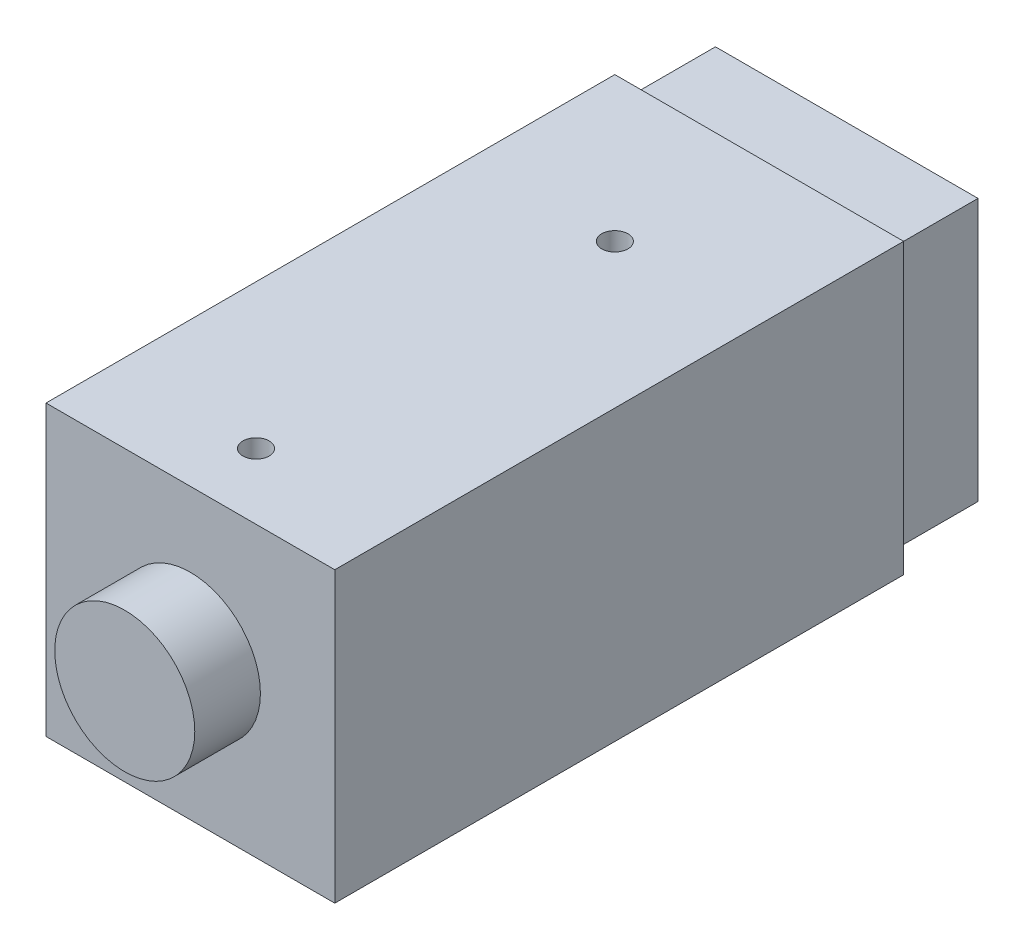
ISO-10303-21;
HEADER;
FILE_DESCRIPTION(('STEP AP214'),'2;1');
FILE_NAME('part.step','',(''),(''),'','','');
FILE_SCHEMA(('AUTOMOTIVE_DESIGN { 1 0 10303 214 1 1 1 1 }'));
ENDSEC;
DATA;
#1=APPLICATION_CONTEXT('core data for automotive mechanical design processes');
#2=APPLICATION_PROTOCOL_DEFINITION('international standard','automotive_design',2000,#1);
#3=PRODUCT_CONTEXT('',#1,'mechanical');
#4=PRODUCT('Part','Part','',(#3));
#5=PRODUCT_RELATED_PRODUCT_CATEGORY('part','',(#4));
#6=PRODUCT_DEFINITION_FORMATION('','',#4);
#7=PRODUCT_DEFINITION_CONTEXT('part definition',#1,'design');
#8=PRODUCT_DEFINITION('design','',#6,#7);
#9=PRODUCT_DEFINITION_SHAPE('','',#8);
#10=(LENGTH_UNIT() NAMED_UNIT(*) SI_UNIT(.MILLI.,.METRE.));
#11=(NAMED_UNIT(*) PLANE_ANGLE_UNIT() SI_UNIT($,.RADIAN.));
#12=(NAMED_UNIT(*) SI_UNIT($,.STERADIAN.) SOLID_ANGLE_UNIT());
#13=UNCERTAINTY_MEASURE_WITH_UNIT(LENGTH_MEASURE(1.E-05),#10,'distance_accuracy_value','');
#14=(GEOMETRIC_REPRESENTATION_CONTEXT(3) GLOBAL_UNCERTAINTY_ASSIGNED_CONTEXT((#13)) GLOBAL_UNIT_ASSIGNED_CONTEXT((#10,
#11,#12)) REPRESENTATION_CONTEXT('',''));
#15=CARTESIAN_POINT('',(0.,0.,0.));
#16=DIRECTION('',(0.,0.,1.));
#17=DIRECTION('',(1.,0.,0.));
#18=AXIS2_PLACEMENT_3D('',#15,#16,#17);
#19=CARTESIAN_POINT('',(0.,0.,0.));
#20=DIRECTION('',(0.,0.,1.));
#21=DIRECTION('',(1.,0.,0.));
#22=AXIS2_PLACEMENT_3D('',#19,#20,#21);
#23=PLANE('',#22);
#24=DIRECTION('',(0.,1.,0.));
#25=VECTOR('',#24,1.);
#26=CARTESIAN_POINT('',(16.5,16.5,0.));
#27=LINE('',#26,#25);
#28=CARTESIAN_POINT('',(16.5,-16.5,0.));
#29=VERTEX_POINT('',#28);
#30=CARTESIAN_POINT('',(16.5,16.5,0.));
#31=VERTEX_POINT('',#30);
#32=EDGE_CURVE('E119',#29,#31,#27,.T.);
#33=ORIENTED_EDGE('',*,*,#32,.F.);
#34=DIRECTION('',(1.,0.,0.));
#35=VECTOR('',#34,1.);
#36=CARTESIAN_POINT('',(-16.5,-16.5,0.));
#37=LINE('',#36,#35);
#38=CARTESIAN_POINT('',(-16.5,-16.5,0.));
#39=VERTEX_POINT('',#38);
#40=EDGE_CURVE('E132',#39,#29,#37,.T.);
#41=ORIENTED_EDGE('',*,*,#40,.F.);
#42=DIRECTION('',(0.,-1.,0.));
#43=VECTOR('',#42,1.);
#44=CARTESIAN_POINT('',(-16.5,16.5,0.));
#45=LINE('',#44,#43);
#46=CARTESIAN_POINT('',(-16.5,16.5,0.));
#47=VERTEX_POINT('',#46);
#48=EDGE_CURVE('E140',#47,#39,#45,.T.);
#49=ORIENTED_EDGE('',*,*,#48,.F.);
#50=DIRECTION('',(-1.,0.,0.));
#51=VECTOR('',#50,1.);
#52=CARTESIAN_POINT('',(-16.5,16.5,0.));
#53=LINE('',#52,#51);
#54=EDGE_CURVE('E122',#31,#47,#53,.T.);
#55=ORIENTED_EDGE('',*,*,#54,.F.);
#56=EDGE_LOOP('',(#33,#41,#49,#55));
#57=FACE_BOUND('',#56,.T.);
#58=DIRECTION('',(0.,1.,0.));
#59=VECTOR('',#58,1.);
#60=CARTESIAN_POINT('',(-15.,15.,0.));
#61=LINE('',#60,#59);
#62=CARTESIAN_POINT('',(-15.,-15.,0.));
#63=VERTEX_POINT('',#62);
#64=CARTESIAN_POINT('',(-15.,15.,0.));
#65=VERTEX_POINT('',#64);
#66=EDGE_CURVE('E118',#63,#65,#61,.T.);
#67=ORIENTED_EDGE('',*,*,#66,.F.);
#68=DIRECTION('',(-1.,0.,0.));
#69=VECTOR('',#68,1.);
#70=CARTESIAN_POINT('',(15.,-15.,0.));
#71=LINE('',#70,#69);
#72=CARTESIAN_POINT('',(15.,-15.,0.));
#73=VERTEX_POINT('',#72);
#74=EDGE_CURVE('E115',#73,#63,#71,.T.);
#75=ORIENTED_EDGE('',*,*,#74,.F.);
#76=DIRECTION('',(0.,-1.,0.));
#77=VECTOR('',#76,1.);
#78=CARTESIAN_POINT('',(15.,15.,0.));
#79=LINE('',#78,#77);
#80=CARTESIAN_POINT('',(15.,15.,0.));
#81=VERTEX_POINT('',#80);
#82=EDGE_CURVE('E53',#81,#73,#79,.T.);
#83=ORIENTED_EDGE('',*,*,#82,.F.);
#84=DIRECTION('',(1.,0.,0.));
#85=VECTOR('',#84,1.);
#86=CARTESIAN_POINT('',(15.,15.,0.));
#87=LINE('',#86,#85);
#88=EDGE_CURVE('E48',#65,#81,#87,.T.);
#89=ORIENTED_EDGE('',*,*,#88,.F.);
#90=EDGE_LOOP('',(#67,#75,#83,#89));
#91=FACE_BOUND('',#90,.T.);
#92=ADVANCED_FACE('F33',(#57,#91),#23,.F.);
#93=CARTESIAN_POINT('',(16.5,16.5,65.));
#94=DIRECTION('',(-1.,0.,0.));
#95=DIRECTION('',(0.,-1.,0.));
#96=AXIS2_PLACEMENT_3D('',#93,#94,#95);
#97=PLANE('',#96);
#98=ORIENTED_EDGE('',*,*,#32,.T.);
#99=DIRECTION('',(0.,0.,-1.));
#100=VECTOR('',#99,1.);
#101=CARTESIAN_POINT('',(16.5,16.5,65.));
#102=LINE('',#101,#100);
#103=CARTESIAN_POINT('',(16.5,16.5,65.));
#104=VERTEX_POINT('',#103);
#105=EDGE_CURVE('E11',#104,#31,#102,.T.);
#106=ORIENTED_EDGE('',*,*,#105,.F.);
#107=DIRECTION('',(0.,1.,0.));
#108=VECTOR('',#107,1.);
#109=CARTESIAN_POINT('',(16.5,16.5,65.));
#110=LINE('',#109,#108);
#111=CARTESIAN_POINT('',(16.5,-16.5,65.));
#112=VERTEX_POINT('',#111);
#113=EDGE_CURVE('E128',#112,#104,#110,.T.);
#114=ORIENTED_EDGE('',*,*,#113,.F.);
#115=DIRECTION('',(0.,0.,-1.));
#116=VECTOR('',#115,1.);
#117=CARTESIAN_POINT('',(16.5,-16.5,65.));
#118=LINE('',#117,#116);
#119=EDGE_CURVE('E137',#112,#29,#118,.T.);
#120=ORIENTED_EDGE('',*,*,#119,.T.);
#121=EDGE_LOOP('',(#98,#106,#114,#120));
#122=FACE_BOUND('',#121,.T.);
#123=ADVANCED_FACE('F35',(#122),#97,.F.);
#124=CARTESIAN_POINT('',(-16.5,16.5,65.));
#125=DIRECTION('',(0.,-1.,0.));
#126=DIRECTION('',(0.,0.,-1.));
#127=AXIS2_PLACEMENT_3D('',#124,#125,#126);
#128=PLANE('',#127);
#129=CARTESIAN_POINT('',(0.,16.5,57.5));
#130=DIRECTION('',(0.,1.,0.));
#131=DIRECTION('',(0.,0.,1.));
#132=AXIS2_PLACEMENT_3D('',#129,#130,#131);
#133=CIRCLE('',#132,1.5);
#134=CARTESIAN_POINT('',(0.,16.5,59.));
#135=VERTEX_POINT('',#134);
#136=EDGE_CURVE('E259',#135,#135,#133,.T.);
#137=ORIENTED_EDGE('',*,*,#136,.F.);
#138=EDGE_LOOP('',(#137));
#139=FACE_BOUND('',#138,.T.);
#140=CARTESIAN_POINT('',(0.,16.5,16.5));
#141=DIRECTION('',(0.,1.,0.));
#142=DIRECTION('',(0.,0.,1.));
#143=AXIS2_PLACEMENT_3D('',#140,#141,#142);
#144=CIRCLE('',#143,1.5);
#145=CARTESIAN_POINT('',(0.,16.5,18.));
#146=VERTEX_POINT('',#145);
#147=EDGE_CURVE('E202',#146,#146,#144,.T.);
#148=ORIENTED_EDGE('',*,*,#147,.F.);
#149=EDGE_LOOP('',(#148));
#150=FACE_BOUND('',#149,.T.);
#151=ORIENTED_EDGE('',*,*,#54,.T.);
#152=DIRECTION('',(0.,0.,-1.));
#153=VECTOR('',#152,1.);
#154=CARTESIAN_POINT('',(-16.5,16.5,65.));
#155=LINE('',#154,#153);
#156=CARTESIAN_POINT('',(-16.5,16.5,65.));
#157=VERTEX_POINT('',#156);
#158=EDGE_CURVE('E41',#157,#47,#155,.T.);
#159=ORIENTED_EDGE('',*,*,#158,.F.);
#160=DIRECTION('',(-1.,0.,0.));
#161=VECTOR('',#160,1.);
#162=CARTESIAN_POINT('',(-16.5,16.5,65.));
#163=LINE('',#162,#161);
#164=EDGE_CURVE('E131',#104,#157,#163,.T.);
#165=ORIENTED_EDGE('',*,*,#164,.F.);
#166=ORIENTED_EDGE('',*,*,#105,.T.);
#167=EDGE_LOOP('',(#151,#159,#165,#166));
#168=FACE_BOUND('',#167,.T.);
#169=ADVANCED_FACE('F167',(#139,#150,#168),#128,.F.);
#170=CARTESIAN_POINT('',(-16.5,16.5,65.));
#171=DIRECTION('',(1.,0.,0.));
#172=DIRECTION('',(0.,1.,0.));
#173=AXIS2_PLACEMENT_3D('',#170,#171,#172);
#174=PLANE('',#173);
#175=ORIENTED_EDGE('',*,*,#48,.T.);
#176=DIRECTION('',(0.,0.,-1.));
#177=VECTOR('',#176,1.);
#178=CARTESIAN_POINT('',(-16.5,-16.5,65.));
#179=LINE('',#178,#177);
#180=CARTESIAN_POINT('',(-16.5,-16.5,65.));
#181=VERTEX_POINT('',#180);
#182=EDGE_CURVE('E145',#181,#39,#179,.T.);
#183=ORIENTED_EDGE('',*,*,#182,.F.);
#184=DIRECTION('',(0.,-1.,0.));
#185=VECTOR('',#184,1.);
#186=CARTESIAN_POINT('',(-16.5,16.5,65.));
#187=LINE('',#186,#185);
#188=EDGE_CURVE('E134',#157,#181,#187,.T.);
#189=ORIENTED_EDGE('',*,*,#188,.F.);
#190=ORIENTED_EDGE('',*,*,#158,.T.);
#191=EDGE_LOOP('',(#175,#183,#189,#190));
#192=FACE_BOUND('',#191,.T.);
#193=ADVANCED_FACE('F152',(#192),#174,.F.);
#194=CARTESIAN_POINT('',(-16.5,-16.5,65.));
#195=DIRECTION('',(0.,1.,0.));
#196=DIRECTION('',(0.,0.,1.));
#197=AXIS2_PLACEMENT_3D('',#194,#195,#196);
#198=PLANE('',#197);
#199=ORIENTED_EDGE('',*,*,#40,.T.);
#200=ORIENTED_EDGE('',*,*,#119,.F.);
#201=DIRECTION('',(1.,0.,0.));
#202=VECTOR('',#201,1.);
#203=CARTESIAN_POINT('',(-16.5,-16.5,65.));
#204=LINE('',#203,#202);
#205=EDGE_CURVE('E136',#181,#112,#204,.T.);
#206=ORIENTED_EDGE('',*,*,#205,.F.);
#207=ORIENTED_EDGE('',*,*,#182,.T.);
#208=EDGE_LOOP('',(#199,#200,#206,#207));
#209=FACE_BOUND('',#208,.T.);
#210=ADVANCED_FACE('F160',(#209),#198,.F.);
#211=CARTESIAN_POINT('',(0.,0.,65.));
#212=DIRECTION('',(0.,0.,1.));
#213=DIRECTION('',(1.,0.,0.));
#214=AXIS2_PLACEMENT_3D('',#211,#212,#213);
#215=PLANE('',#214);
#216=CARTESIAN_POINT('',(0.,0.,65.));
#217=DIRECTION('',(0.,0.,1.));
#218=DIRECTION('',(1.,0.,0.));
#219=AXIS2_PLACEMENT_3D('',#216,#217,#218);
#220=CIRCLE('',#219,8.);
#221=CARTESIAN_POINT('',(8.,0.,65.));
#222=VERTEX_POINT('',#221);
#223=EDGE_CURVE('E194',#222,#222,#220,.T.);
#224=ORIENTED_EDGE('',*,*,#223,.F.);
#225=EDGE_LOOP('',(#224));
#226=FACE_BOUND('',#225,.T.);
#227=ORIENTED_EDGE('',*,*,#113,.T.);
#228=ORIENTED_EDGE('',*,*,#164,.T.);
#229=ORIENTED_EDGE('',*,*,#188,.T.);
#230=ORIENTED_EDGE('',*,*,#205,.T.);
#231=EDGE_LOOP('',(#227,#228,#229,#230));
#232=FACE_BOUND('',#231,.T.);
#233=ADVANCED_FACE('F166',(#226,#232),#215,.T.);
#234=CARTESIAN_POINT('',(-15.,15.,-10.));
#235=DIRECTION('',(1.,0.,0.));
#236=DIRECTION('',(0.,1.,0.));
#237=AXIS2_PLACEMENT_3D('',#234,#235,#236);
#238=PLANE('',#237);
#239=ORIENTED_EDGE('',*,*,#66,.T.);
#240=DIRECTION('',(0.,0.,1.));
#241=VECTOR('',#240,1.);
#242=CARTESIAN_POINT('',(-15.,15.,-10.));
#243=LINE('',#242,#241);
#244=CARTESIAN_POINT('',(-15.,15.,-10.));
#245=VERTEX_POINT('',#244);
#246=EDGE_CURVE('E99',#245,#65,#243,.T.);
#247=ORIENTED_EDGE('',*,*,#246,.F.);
#248=DIRECTION('',(0.,1.,0.));
#249=VECTOR('',#248,1.);
#250=CARTESIAN_POINT('',(-15.,15.,-10.));
#251=LINE('',#250,#249);
#252=CARTESIAN_POINT('',(-15.,-15.,-10.));
#253=VERTEX_POINT('',#252);
#254=EDGE_CURVE('E106',#253,#245,#251,.T.);
#255=ORIENTED_EDGE('',*,*,#254,.F.);
#256=DIRECTION('',(0.,0.,1.));
#257=VECTOR('',#256,1.);
#258=CARTESIAN_POINT('',(-15.,-15.,-10.));
#259=LINE('',#258,#257);
#260=EDGE_CURVE('E208',#253,#63,#259,.T.);
#261=ORIENTED_EDGE('',*,*,#260,.T.);
#262=EDGE_LOOP('',(#239,#247,#255,#261));
#263=FACE_BOUND('',#262,.T.);
#264=ADVANCED_FACE('F117',(#263),#238,.F.);
#265=CARTESIAN_POINT('',(15.,15.,-10.));
#266=DIRECTION('',(0.,-1.,0.));
#267=DIRECTION('',(0.,0.,-1.));
#268=AXIS2_PLACEMENT_3D('',#265,#266,#267);
#269=PLANE('',#268);
#270=ORIENTED_EDGE('',*,*,#88,.T.);
#271=DIRECTION('',(0.,0.,1.));
#272=VECTOR('',#271,1.);
#273=CARTESIAN_POINT('',(15.,15.,-10.));
#274=LINE('',#273,#272);
#275=CARTESIAN_POINT('',(15.,15.,-10.));
#276=VERTEX_POINT('',#275);
#277=EDGE_CURVE('E102',#276,#81,#274,.T.);
#278=ORIENTED_EDGE('',*,*,#277,.F.);
#279=DIRECTION('',(1.,0.,0.));
#280=VECTOR('',#279,1.);
#281=CARTESIAN_POINT('',(15.,15.,-10.));
#282=LINE('',#281,#280);
#283=EDGE_CURVE('E95',#245,#276,#282,.T.);
#284=ORIENTED_EDGE('',*,*,#283,.F.);
#285=ORIENTED_EDGE('',*,*,#246,.T.);
#286=EDGE_LOOP('',(#270,#278,#284,#285));
#287=FACE_BOUND('',#286,.T.);
#288=ADVANCED_FACE('F97',(#287),#269,.F.);
#289=CARTESIAN_POINT('',(15.,15.,-10.));
#290=DIRECTION('',(-1.,0.,0.));
#291=DIRECTION('',(0.,-1.,0.));
#292=AXIS2_PLACEMENT_3D('',#289,#290,#291);
#293=PLANE('',#292);
#294=ORIENTED_EDGE('',*,*,#82,.T.);
#295=DIRECTION('',(0.,0.,1.));
#296=VECTOR('',#295,1.);
#297=CARTESIAN_POINT('',(15.,-15.,-10.));
#298=LINE('',#297,#296);
#299=CARTESIAN_POINT('',(15.,-15.,-10.));
#300=VERTEX_POINT('',#299);
#301=EDGE_CURVE('E124',#300,#73,#298,.T.);
#302=ORIENTED_EDGE('',*,*,#301,.F.);
#303=DIRECTION('',(0.,-1.,0.));
#304=VECTOR('',#303,1.);
#305=CARTESIAN_POINT('',(15.,15.,-10.));
#306=LINE('',#305,#304);
#307=EDGE_CURVE('E105',#276,#300,#306,.T.);
#308=ORIENTED_EDGE('',*,*,#307,.F.);
#309=ORIENTED_EDGE('',*,*,#277,.T.);
#310=EDGE_LOOP('',(#294,#302,#308,#309));
#311=FACE_BOUND('',#310,.T.);
#312=ADVANCED_FACE('F219',(#311),#293,.F.);
#313=CARTESIAN_POINT('',(15.,-15.,-10.));
#314=DIRECTION('',(0.,1.,0.));
#315=DIRECTION('',(0.,0.,1.));
#316=AXIS2_PLACEMENT_3D('',#313,#314,#315);
#317=PLANE('',#316);
#318=ORIENTED_EDGE('',*,*,#74,.T.);
#319=ORIENTED_EDGE('',*,*,#260,.F.);
#320=DIRECTION('',(-1.,0.,0.));
#321=VECTOR('',#320,1.);
#322=CARTESIAN_POINT('',(15.,-15.,-10.));
#323=LINE('',#322,#321);
#324=EDGE_CURVE('E111',#300,#253,#323,.T.);
#325=ORIENTED_EDGE('',*,*,#324,.F.);
#326=ORIENTED_EDGE('',*,*,#301,.T.);
#327=EDGE_LOOP('',(#318,#319,#325,#326));
#328=FACE_BOUND('',#327,.T.);
#329=ADVANCED_FACE('F217',(#328),#317,.F.);
#330=CARTESIAN_POINT('',(0.,0.,-10.));
#331=DIRECTION('',(0.,0.,-1.));
#332=DIRECTION('',(-1.,0.,0.));
#333=AXIS2_PLACEMENT_3D('',#330,#331,#332);
#334=PLANE('',#333);
#335=ORIENTED_EDGE('',*,*,#254,.T.);
#336=ORIENTED_EDGE('',*,*,#283,.T.);
#337=ORIENTED_EDGE('',*,*,#307,.T.);
#338=ORIENTED_EDGE('',*,*,#324,.T.);
#339=EDGE_LOOP('',(#335,#336,#337,#338));
#340=FACE_BOUND('',#339,.T.);
#341=ADVANCED_FACE('F109',(#340),#334,.T.);
#342=CARTESIAN_POINT('',(0.,0.,72.5));
#343=DIRECTION('',(0.,0.,-1.));
#344=DIRECTION('',(-1.,0.,0.));
#345=AXIS2_PLACEMENT_3D('',#342,#343,#344);
#346=CYLINDRICAL_SURFACE('',#345,8.);
#347=CARTESIAN_POINT('',(0.,0.,72.5));
#348=DIRECTION('',(0.,0.,1.));
#349=DIRECTION('',(1.,0.,0.));
#350=AXIS2_PLACEMENT_3D('',#347,#348,#349);
#351=CIRCLE('',#350,8.);
#352=CARTESIAN_POINT('',(8.,0.,72.5));
#353=VERTEX_POINT('',#352);
#354=EDGE_CURVE('E196',#353,#353,#351,.T.);
#355=ORIENTED_EDGE('',*,*,#354,.F.);
#356=EDGE_LOOP('',(#355));
#357=FACE_BOUND('',#356,.T.);
#358=ORIENTED_EDGE('',*,*,#223,.T.);
#359=EDGE_LOOP('',(#358));
#360=FACE_BOUND('',#359,.T.);
#361=ADVANCED_FACE('F231',(#357,#360),#346,.T.);
#362=CARTESIAN_POINT('',(0.,0.,72.5));
#363=DIRECTION('',(0.,0.,1.));
#364=DIRECTION('',(1.,0.,0.));
#365=AXIS2_PLACEMENT_3D('',#362,#363,#364);
#366=PLANE('',#365);
#367=ORIENTED_EDGE('',*,*,#354,.T.);
#368=EDGE_LOOP('',(#367));
#369=FACE_BOUND('',#368,.T.);
#370=ADVANCED_FACE('F234',(#369),#366,.T.);
#371=CARTESIAN_POINT('',(0.,9.00000000000001,16.5));
#372=DIRECTION('',(0.,1.,0.));
#373=DIRECTION('',(0.,0.,1.));
#374=AXIS2_PLACEMENT_3D('',#371,#372,#373);
#375=CYLINDRICAL_SURFACE('',#374,1.5);
#376=CARTESIAN_POINT('',(0.,9.00000000000001,16.5));
#377=DIRECTION('',(0.,1.,0.));
#378=DIRECTION('',(0.,0.,1.));
#379=AXIS2_PLACEMENT_3D('',#376,#377,#378);
#380=CIRCLE('',#379,1.5);
#381=CARTESIAN_POINT('',(0.,9.00000000000001,18.));
#382=VERTEX_POINT('',#381);
#383=EDGE_CURVE('E197',#382,#382,#380,.T.);
#384=ORIENTED_EDGE('',*,*,#383,.F.);
#385=EDGE_LOOP('',(#384));
#386=FACE_BOUND('',#385,.T.);
#387=ORIENTED_EDGE('',*,*,#147,.T.);
#388=EDGE_LOOP('',(#387));
#389=FACE_BOUND('',#388,.T.);
#390=ADVANCED_FACE('F238',(#386,#389),#375,.F.);
#391=CARTESIAN_POINT('',(0.,9.00000000000001,16.5));
#392=DIRECTION('',(0.,1.,0.));
#393=DIRECTION('',(0.,0.,1.));
#394=AXIS2_PLACEMENT_3D('',#391,#392,#393);
#395=PLANE('',#394);
#396=ORIENTED_EDGE('',*,*,#383,.T.);
#397=EDGE_LOOP('',(#396));
#398=FACE_BOUND('',#397,.T.);
#399=ADVANCED_FACE('F242',(#398),#395,.T.);
#400=CARTESIAN_POINT('',(0.,9.00000000000001,57.5));
#401=DIRECTION('',(0.,1.,0.));
#402=DIRECTION('',(0.,0.,1.));
#403=AXIS2_PLACEMENT_3D('',#400,#401,#402);
#404=CYLINDRICAL_SURFACE('',#403,1.5);
#405=CARTESIAN_POINT('',(0.,9.00000000000001,57.5));
#406=DIRECTION('',(0.,1.,0.));
#407=DIRECTION('',(0.,0.,1.));
#408=AXIS2_PLACEMENT_3D('',#405,#406,#407);
#409=CIRCLE('',#408,1.5);
#410=CARTESIAN_POINT('',(0.,9.00000000000001,59.));
#411=VERTEX_POINT('',#410);
#412=EDGE_CURVE('E258',#411,#411,#409,.T.);
#413=ORIENTED_EDGE('',*,*,#412,.F.);
#414=EDGE_LOOP('',(#413));
#415=FACE_BOUND('',#414,.T.);
#416=ORIENTED_EDGE('',*,*,#136,.T.);
#417=EDGE_LOOP('',(#416));
#418=FACE_BOUND('',#417,.T.);
#419=ADVANCED_FACE('F246',(#415,#418),#404,.F.);
#420=CARTESIAN_POINT('',(0.,9.00000000000001,57.5));
#421=DIRECTION('',(0.,1.,0.));
#422=DIRECTION('',(0.,0.,1.));
#423=AXIS2_PLACEMENT_3D('',#420,#421,#422);
#424=PLANE('',#423);
#425=ORIENTED_EDGE('',*,*,#412,.T.);
#426=EDGE_LOOP('',(#425));
#427=FACE_BOUND('',#426,.T.);
#428=ADVANCED_FACE('F250',(#427),#424,.T.);
#429=CLOSED_SHELL('',(#92,#123,#169,#193,#210,#233,#264,#288,#312,#329,#341,#361,#370,#390,#399,
#419,#428));
#430=MANIFOLD_SOLID_BREP('B2',#429);
#431=ADVANCED_BREP_SHAPE_REPRESENTATION('',(#18,#430),#14);
#432=SHAPE_DEFINITION_REPRESENTATION(#9,#431);
ENDSEC;
END-ISO-10303-21;
